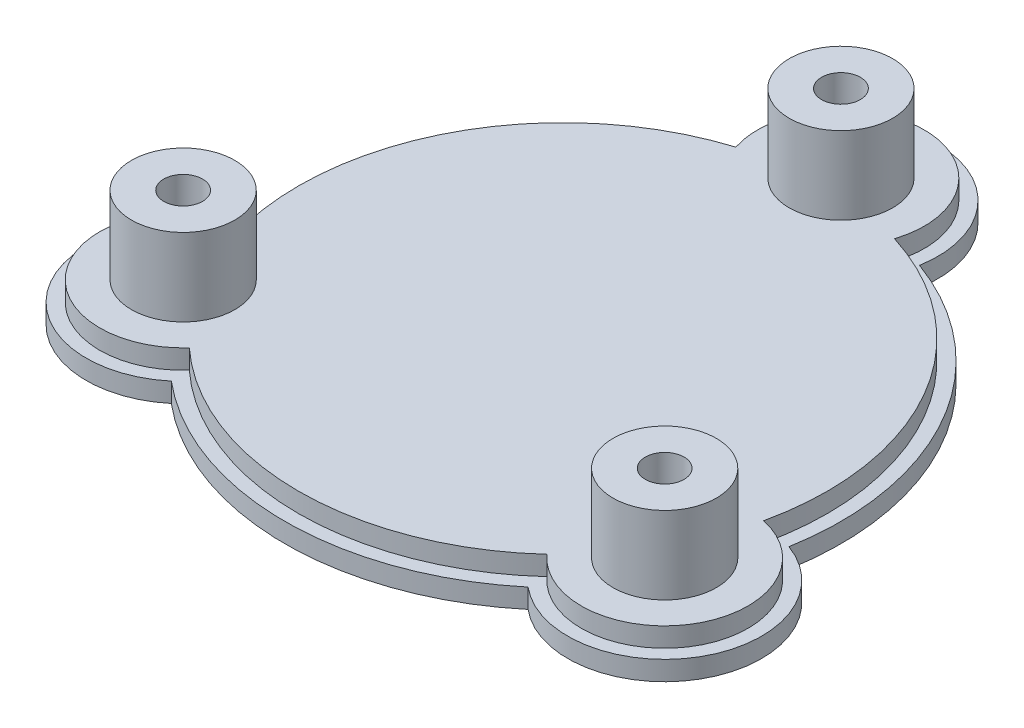
ISO-10303-21;
HEADER;
FILE_DESCRIPTION(('STEP AP214'),'2;1');
FILE_NAME('part.step','',(''),(''),'','','');
FILE_SCHEMA(('AUTOMOTIVE_DESIGN { 1 0 10303 214 1 1 1 1 }'));
ENDSEC;
DATA;
#1=APPLICATION_CONTEXT('core data for automotive mechanical design processes');
#2=APPLICATION_PROTOCOL_DEFINITION('international standard','automotive_design',2000,#1);
#3=PRODUCT_CONTEXT('',#1,'mechanical');
#4=PRODUCT('Part','Part','',(#3));
#5=PRODUCT_RELATED_PRODUCT_CATEGORY('part','',(#4));
#6=PRODUCT_DEFINITION_FORMATION('','',#4);
#7=PRODUCT_DEFINITION_CONTEXT('part definition',#1,'design');
#8=PRODUCT_DEFINITION('design','',#6,#7);
#9=PRODUCT_DEFINITION_SHAPE('','',#8);
#10=(LENGTH_UNIT() NAMED_UNIT(*) SI_UNIT(.MILLI.,.METRE.));
#11=(NAMED_UNIT(*) PLANE_ANGLE_UNIT() SI_UNIT($,.RADIAN.));
#12=(NAMED_UNIT(*) SI_UNIT($,.STERADIAN.) SOLID_ANGLE_UNIT());
#13=UNCERTAINTY_MEASURE_WITH_UNIT(LENGTH_MEASURE(1.E-05),#10,'distance_accuracy_value','');
#14=(GEOMETRIC_REPRESENTATION_CONTEXT(3) GLOBAL_UNCERTAINTY_ASSIGNED_CONTEXT((#13)) GLOBAL_UNIT_ASSIGNED_CONTEXT((#10,
#11,#12)) REPRESENTATION_CONTEXT('',''));
#15=CARTESIAN_POINT('',(0.,0.,0.));
#16=DIRECTION('',(0.,0.,1.));
#17=DIRECTION('',(1.,0.,0.));
#18=AXIS2_PLACEMENT_3D('',#15,#16,#17);
#19=CARTESIAN_POINT('',(37.2390923627336,3.,21.4999999999984));
#20=DIRECTION('',(0.,-1.,0.));
#21=DIRECTION('',(0.,0.,-1.));
#22=AXIS2_PLACEMENT_3D('',#19,#20,#21);
#23=CYLINDRICAL_SURFACE('',#22,6.);
#24=CARTESIAN_POINT('',(37.2390923627336,0.,21.4999999999984));
#25=DIRECTION('',(0.,1.,0.));
#26=DIRECTION('',(0.,0.,1.));
#27=AXIS2_PLACEMENT_3D('',#24,#25,#26);
#28=CIRCLE('',#27,6.);
#29=CARTESIAN_POINT('',(37.2390923627336,0.,27.4999999999984));
#30=VERTEX_POINT('',#29);
#31=EDGE_CURVE('E222',#30,#30,#28,.T.);
#32=ORIENTED_EDGE('',*,*,#31,.F.);
#33=EDGE_LOOP('',(#32));
#34=FACE_BOUND('',#33,.T.);
#35=CARTESIAN_POINT('',(37.2390923627307,12.,21.4999999999972));
#36=DIRECTION('',(0.,1.,0.));
#37=DIRECTION('',(0.,0.,1.));
#38=AXIS2_PLACEMENT_3D('',#35,#36,#37);
#39=CIRCLE('',#38,6.);
#40=CARTESIAN_POINT('',(37.2390923627307,12.,27.4999999999972));
#41=VERTEX_POINT('',#40);
#42=EDGE_CURVE('E410',#41,#41,#39,.T.);
#43=ORIENTED_EDGE('',*,*,#42,.T.);
#44=EDGE_LOOP('',(#43));
#45=FACE_BOUND('',#44,.T.);
#46=ADVANCED_FACE('F219',(#34,#45),#23,.F.);
#47=CARTESIAN_POINT('',(0.,3.,-43.));
#48=DIRECTION('',(0.,-1.,0.));
#49=DIRECTION('',(0.,0.,-1.));
#50=AXIS2_PLACEMENT_3D('',#47,#48,#49);
#51=CYLINDRICAL_SURFACE('',#50,6.);
#52=CARTESIAN_POINT('',(0.,0.,-43.));
#53=DIRECTION('',(0.,1.,0.));
#54=DIRECTION('',(0.,0.,1.));
#55=AXIS2_PLACEMENT_3D('',#52,#53,#54);
#56=CIRCLE('',#55,6.);
#57=CARTESIAN_POINT('',(0.,0.,-37.));
#58=VERTEX_POINT('',#57);
#59=EDGE_CURVE('E345',#58,#58,#56,.T.);
#60=ORIENTED_EDGE('',*,*,#59,.F.);
#61=EDGE_LOOP('',(#60));
#62=FACE_BOUND('',#61,.T.);
#63=CARTESIAN_POINT('',(-2.55698240358981E-12,12.,-42.9999999999984));
#64=DIRECTION('',(0.,1.,0.));
#65=DIRECTION('',(0.,0.,1.));
#66=AXIS2_PLACEMENT_3D('',#63,#64,#65);
#67=CIRCLE('',#66,5.99999999999999);
#68=CARTESIAN_POINT('',(-2.55698240358981E-12,12.,-36.9999999999984));
#69=VERTEX_POINT('',#68);
#70=EDGE_CURVE('E422',#69,#69,#67,.T.);
#71=ORIENTED_EDGE('',*,*,#70,.T.);
#72=EDGE_LOOP('',(#71));
#73=FACE_BOUND('',#72,.T.);
#74=ADVANCED_FACE('F400',(#62,#73),#51,.F.);
#75=CARTESIAN_POINT('',(-37.2390923627281,3.,21.5000000000016));
#76=DIRECTION('',(0.,-1.,0.));
#77=DIRECTION('',(0.,0.,-1.));
#78=AXIS2_PLACEMENT_3D('',#75,#76,#77);
#79=CYLINDRICAL_SURFACE('',#78,6.);
#80=CARTESIAN_POINT('',(-37.2390923627281,0.,21.5000000000016));
#81=DIRECTION('',(0.,1.,0.));
#82=DIRECTION('',(0.,0.,1.));
#83=AXIS2_PLACEMENT_3D('',#80,#81,#82);
#84=CIRCLE('',#83,6.);
#85=CARTESIAN_POINT('',(-37.2390923627281,0.,27.5000000000016));
#86=VERTEX_POINT('',#85);
#87=EDGE_CURVE('E348',#86,#86,#84,.T.);
#88=ORIENTED_EDGE('',*,*,#87,.F.);
#89=EDGE_LOOP('',(#88));
#90=FACE_BOUND('',#89,.T.);
#91=CARTESIAN_POINT('',(-37.2390923627281,12.,21.5000000000016));
#92=DIRECTION('',(0.,1.,0.));
#93=DIRECTION('',(0.,0.,1.));
#94=AXIS2_PLACEMENT_3D('',#91,#92,#93);
#95=CIRCLE('',#94,5.99999999999999);
#96=CARTESIAN_POINT('',(-37.2390923627281,12.,27.5000000000016));
#97=VERTEX_POINT('',#96);
#98=EDGE_CURVE('E440',#97,#97,#95,.T.);
#99=ORIENTED_EDGE('',*,*,#98,.T.);
#100=EDGE_LOOP('',(#99));
#101=FACE_BOUND('',#100,.T.);
#102=ADVANCED_FACE('F405',(#90,#101),#79,.F.);
#103=CARTESIAN_POINT('',(0.,3.,0.));
#104=DIRECTION('',(0.,1.,0.));
#105=DIRECTION('',(0.,0.,1.));
#106=AXIS2_PLACEMENT_3D('',#103,#104,#105);
#107=PLANE('',#106);
#108=CARTESIAN_POINT('',(0.,3.,-43.));
#109=DIRECTION('',(0.,1.,0.));
#110=DIRECTION('',(0.,0.,1.));
#111=AXIS2_PLACEMENT_3D('',#108,#109,#110);
#112=CIRCLE('',#111,12.9);
#113=CARTESIAN_POINT('',(12.2694729939809,3.,-39.0162790697674));
#114=VERTEX_POINT('',#113);
#115=CARTESIAN_POINT('',(-12.2694729939809,3.,-39.0162790697674));
#116=VERTEX_POINT('',#115);
#117=EDGE_CURVE('E489',#114,#116,#112,.T.);
#118=ORIENTED_EDGE('',*,*,#117,.F.);
#119=CARTESIAN_POINT('',(0.,3.,0.));
#120=DIRECTION('',(0.,1.,0.));
#121=DIRECTION('',(0.,0.,1.));
#122=AXIS2_PLACEMENT_3D('',#119,#120,#121);
#123=CIRCLE('',#122,40.9);
#124=CARTESIAN_POINT('',(39.9238253325531,3.,8.88246423104476));
#125=VERTEX_POINT('',#124);
#126=EDGE_CURVE('E447',#125,#114,#123,.T.);
#127=ORIENTED_EDGE('',*,*,#126,.F.);
#128=CARTESIAN_POINT('',(37.2390923627336,3.,21.4999999999984));
#129=DIRECTION('',(0.,1.,0.));
#130=DIRECTION('',(0.,0.,1.));
#131=AXIS2_PLACEMENT_3D('',#128,#129,#130);
#132=CIRCLE('',#131,12.9000000000024);
#133=CARTESIAN_POINT('',(27.6543523385718,3.,30.1338148387178));
#134=VERTEX_POINT('',#133);
#135=EDGE_CURVE('E453',#134,#125,#132,.T.);
#136=ORIENTED_EDGE('',*,*,#135,.F.);
#137=CARTESIAN_POINT('',(0.,3.,0.));
#138=DIRECTION('',(0.,1.,0.));
#139=DIRECTION('',(0.,0.,1.));
#140=AXIS2_PLACEMENT_3D('',#137,#138,#139);
#141=CIRCLE('',#140,40.9);
#142=CARTESIAN_POINT('',(-27.6543523385664,3.,30.1338148387228));
#143=VERTEX_POINT('',#142);
#144=EDGE_CURVE('E501',#143,#134,#141,.T.);
#145=ORIENTED_EDGE('',*,*,#144,.F.);
#146=CARTESIAN_POINT('',(-37.2390923627281,3.,21.5000000000016));
#147=DIRECTION('',(0.,1.,0.));
#148=DIRECTION('',(0.,0.,1.));
#149=AXIS2_PLACEMENT_3D('',#146,#147,#148);
#150=CIRCLE('',#149,12.9000000000035);
#151=CARTESIAN_POINT('',(-39.9238253325525,3.,8.88246423104779));
#152=VERTEX_POINT('',#151);
#153=EDGE_CURVE('E497',#152,#143,#150,.T.);
#154=ORIENTED_EDGE('',*,*,#153,.F.);
#155=CARTESIAN_POINT('',(0.,3.,0.));
#156=DIRECTION('',(0.,1.,0.));
#157=DIRECTION('',(0.,0.,1.));
#158=AXIS2_PLACEMENT_3D('',#155,#156,#157);
#159=CIRCLE('',#158,40.9);
#160=EDGE_CURVE('E493',#116,#152,#159,.T.);
#161=ORIENTED_EDGE('',*,*,#160,.F.);
#162=EDGE_LOOP('',(#118,#127,#136,#145,#154,#161));
#163=FACE_BOUND('',#162,.T.);
#164=CARTESIAN_POINT('',(37.2390923627336,3.,21.4999999999984));
#165=DIRECTION('',(0.,1.,0.));
#166=DIRECTION('',(0.,0.,1.));
#167=AXIS2_PLACEMENT_3D('',#164,#165,#166);
#168=CIRCLE('',#167,15.0000000000024);
#169=CARTESIAN_POINT('',(27.5882912610838,3.,32.9831197022599));
#170=VERTEX_POINT('',#169);
#171=CARTESIAN_POINT('',(42.358365188763,3.,7.40060122796745));
#172=VERTEX_POINT('',#171);
#173=EDGE_CURVE('E369',#170,#172,#168,.T.);
#174=ORIENTED_EDGE('',*,*,#173,.T.);
#175=CARTESIAN_POINT('',(0.,3.,0.));
#176=DIRECTION('',(0.,1.,0.));
#177=DIRECTION('',(0.,0.,1.));
#178=AXIS2_PLACEMENT_3D('',#175,#176,#177);
#179=CIRCLE('',#178,43.);
#180=CARTESIAN_POINT('',(14.7700739276788,3.,-40.3837209302326));
#181=VERTEX_POINT('',#180);
#182=EDGE_CURVE('E280',#172,#181,#179,.T.);
#183=ORIENTED_EDGE('',*,*,#182,.T.);
#184=CARTESIAN_POINT('',(0.,3.,-43.));
#185=DIRECTION('',(0.,1.,0.));
#186=DIRECTION('',(0.,0.,1.));
#187=AXIS2_PLACEMENT_3D('',#184,#185,#186);
#188=CIRCLE('',#187,15.);
#189=CARTESIAN_POINT('',(-14.7700739276788,3.,-40.3837209302326));
#190=VERTEX_POINT('',#189);
#191=EDGE_CURVE('E298',#181,#190,#188,.T.);
#192=ORIENTED_EDGE('',*,*,#191,.T.);
#193=CARTESIAN_POINT('',(-42.3583651887623,3.,7.40060122797118));
#194=VERTEX_POINT('',#193);
#195=EDGE_CURVE('E291',#190,#194,#179,.T.);
#196=ORIENTED_EDGE('',*,*,#195,.T.);
#197=CARTESIAN_POINT('',(-37.2390923627281,3.,21.5000000000016));
#198=DIRECTION('',(0.,1.,0.));
#199=DIRECTION('',(0.,0.,1.));
#200=AXIS2_PLACEMENT_3D('',#197,#198,#199);
#201=CIRCLE('',#200,15.0000000000035);
#202=CARTESIAN_POINT('',(-27.5882912610783,3.,32.9831197022645));
#203=VERTEX_POINT('',#202);
#204=EDGE_CURVE('E295',#194,#203,#201,.T.);
#205=ORIENTED_EDGE('',*,*,#204,.T.);
#206=EDGE_CURVE('E245',#203,#170,#179,.T.);
#207=ORIENTED_EDGE('',*,*,#206,.T.);
#208=EDGE_LOOP('',(#174,#183,#192,#196,#205,#207));
#209=FACE_BOUND('',#208,.T.);
#210=ADVANCED_FACE('F293',(#163,#209),#107,.T.);
#211=CARTESIAN_POINT('',(0.,3.,0.));
#212=DIRECTION('',(0.,-1.,0.));
#213=DIRECTION('',(0.,0.,-1.));
#214=AXIS2_PLACEMENT_3D('',#211,#212,#213);
#215=CYLINDRICAL_SURFACE('',#214,43.);
#216=CARTESIAN_POINT('',(0.,0.,0.));
#217=DIRECTION('',(0.,1.,0.));
#218=DIRECTION('',(0.,0.,1.));
#219=AXIS2_PLACEMENT_3D('',#216,#217,#218);
#220=CIRCLE('',#219,43.);
#221=CARTESIAN_POINT('',(42.358365188763,0.,7.40060122796745));
#222=VERTEX_POINT('',#221);
#223=CARTESIAN_POINT('',(14.7700739276788,0.,-40.3837209302326));
#224=VERTEX_POINT('',#223);
#225=EDGE_CURVE('E324',#222,#224,#220,.T.);
#226=ORIENTED_EDGE('',*,*,#225,.T.);
#227=DIRECTION('',(0.,-1.,0.));
#228=VECTOR('',#227,1.);
#229=CARTESIAN_POINT('',(14.7700739276788,3.,-40.3837209302326));
#230=LINE('',#229,#228);
#231=EDGE_CURVE('E228',#181,#224,#230,.T.);
#232=ORIENTED_EDGE('',*,*,#231,.F.);
#233=ORIENTED_EDGE('',*,*,#182,.F.);
#234=DIRECTION('',(0.,-1.,0.));
#235=VECTOR('',#234,1.);
#236=CARTESIAN_POINT('',(42.358365188763,3.,7.40060122796745));
#237=LINE('',#236,#235);
#238=EDGE_CURVE('E12',#172,#222,#237,.T.);
#239=ORIENTED_EDGE('',*,*,#238,.T.);
#240=EDGE_LOOP('',(#226,#232,#233,#239));
#241=FACE_BOUND('',#240,.T.);
#242=ADVANCED_FACE('F379',(#241),#215,.T.);
#243=CARTESIAN_POINT('',(-14.7700739276788,0.,-40.3837209302326));
#244=VERTEX_POINT('',#243);
#245=CARTESIAN_POINT('',(-42.3583651887623,0.,7.40060122797118));
#246=VERTEX_POINT('',#245);
#247=EDGE_CURVE('E306',#244,#246,#220,.T.);
#248=ORIENTED_EDGE('',*,*,#247,.T.);
#249=DIRECTION('',(0.,-1.,0.));
#250=VECTOR('',#249,1.);
#251=CARTESIAN_POINT('',(-42.3583651887623,3.,7.40060122797118));
#252=LINE('',#251,#250);
#253=EDGE_CURVE('E303',#194,#246,#252,.T.);
#254=ORIENTED_EDGE('',*,*,#253,.F.);
#255=ORIENTED_EDGE('',*,*,#195,.F.);
#256=DIRECTION('',(0.,-1.,0.));
#257=VECTOR('',#256,1.);
#258=CARTESIAN_POINT('',(-14.7700739276788,3.,-40.3837209302326));
#259=LINE('',#258,#257);
#260=EDGE_CURVE('E310',#190,#244,#259,.T.);
#261=ORIENTED_EDGE('',*,*,#260,.T.);
#262=EDGE_LOOP('',(#248,#254,#255,#261));
#263=FACE_BOUND('',#262,.T.);
#264=ADVANCED_FACE('F304',(#263),#215,.T.);
#265=CARTESIAN_POINT('',(-37.2390923627281,3.,21.5000000000016));
#266=DIRECTION('',(0.,-1.,0.));
#267=DIRECTION('',(0.,0.,-1.));
#268=AXIS2_PLACEMENT_3D('',#265,#266,#267);
#269=CYLINDRICAL_SURFACE('',#268,15.0000000000035);
#270=CARTESIAN_POINT('',(-37.2390923627281,0.,21.5000000000016));
#271=DIRECTION('',(0.,1.,0.));
#272=DIRECTION('',(0.,0.,1.));
#273=AXIS2_PLACEMENT_3D('',#270,#271,#272);
#274=CIRCLE('',#273,15.0000000000035);
#275=CARTESIAN_POINT('',(-27.5882912610783,0.,32.9831197022645));
#276=VERTEX_POINT('',#275);
#277=EDGE_CURVE('E328',#246,#276,#274,.T.);
#278=ORIENTED_EDGE('',*,*,#277,.T.);
#279=DIRECTION('',(0.,-1.,0.));
#280=VECTOR('',#279,1.);
#281=CARTESIAN_POINT('',(-27.5882912610783,3.,32.9831197022645));
#282=LINE('',#281,#280);
#283=EDGE_CURVE('E311',#203,#276,#282,.T.);
#284=ORIENTED_EDGE('',*,*,#283,.F.);
#285=ORIENTED_EDGE('',*,*,#204,.F.);
#286=ORIENTED_EDGE('',*,*,#253,.T.);
#287=EDGE_LOOP('',(#278,#284,#285,#286));
#288=FACE_BOUND('',#287,.T.);
#289=ADVANCED_FACE('F313',(#288),#269,.T.);
#290=CARTESIAN_POINT('',(27.5882912610838,0.,32.9831197022599));
#291=VERTEX_POINT('',#290);
#292=EDGE_CURVE('E272',#276,#291,#220,.T.);
#293=ORIENTED_EDGE('',*,*,#292,.T.);
#294=DIRECTION('',(0.,-1.,0.));
#295=VECTOR('',#294,1.);
#296=CARTESIAN_POINT('',(27.5882912610838,3.,32.9831197022599));
#297=LINE('',#296,#295);
#298=EDGE_CURVE('E317',#170,#291,#297,.T.);
#299=ORIENTED_EDGE('',*,*,#298,.F.);
#300=ORIENTED_EDGE('',*,*,#206,.F.);
#301=ORIENTED_EDGE('',*,*,#283,.T.);
#302=EDGE_LOOP('',(#293,#299,#300,#301));
#303=FACE_BOUND('',#302,.T.);
#304=ADVANCED_FACE('F558',(#303),#215,.T.);
#305=CARTESIAN_POINT('',(37.2390923627336,3.,21.4999999999984));
#306=DIRECTION('',(0.,-1.,0.));
#307=DIRECTION('',(0.,0.,-1.));
#308=AXIS2_PLACEMENT_3D('',#305,#306,#307);
#309=CYLINDRICAL_SURFACE('',#308,15.0000000000024);
#310=CARTESIAN_POINT('',(37.2390923627336,0.,21.4999999999984));
#311=DIRECTION('',(0.,1.,0.));
#312=DIRECTION('',(0.,0.,1.));
#313=AXIS2_PLACEMENT_3D('',#310,#311,#312);
#314=CIRCLE('',#313,15.0000000000024);
#315=EDGE_CURVE('E320',#291,#222,#314,.T.);
#316=ORIENTED_EDGE('',*,*,#315,.T.);
#317=ORIENTED_EDGE('',*,*,#238,.F.);
#318=ORIENTED_EDGE('',*,*,#173,.F.);
#319=ORIENTED_EDGE('',*,*,#298,.T.);
#320=EDGE_LOOP('',(#316,#317,#318,#319));
#321=FACE_BOUND('',#320,.T.);
#322=ADVANCED_FACE('F377',(#321),#309,.T.);
#323=CARTESIAN_POINT('',(0.,0.,0.));
#324=DIRECTION('',(0.,1.,0.));
#325=DIRECTION('',(0.,0.,1.));
#326=AXIS2_PLACEMENT_3D('',#323,#324,#325);
#327=PLANE('',#326);
#328=ORIENTED_EDGE('',*,*,#59,.T.);
#329=EDGE_LOOP('',(#328));
#330=FACE_BOUND('',#329,.T.);
#331=ORIENTED_EDGE('',*,*,#315,.F.);
#332=ORIENTED_EDGE('',*,*,#292,.F.);
#333=ORIENTED_EDGE('',*,*,#277,.F.);
#334=ORIENTED_EDGE('',*,*,#247,.F.);
#335=CARTESIAN_POINT('',(0.,0.,-43.));
#336=DIRECTION('',(0.,1.,0.));
#337=DIRECTION('',(0.,0.,1.));
#338=AXIS2_PLACEMENT_3D('',#335,#336,#337);
#339=CIRCLE('',#338,15.);
#340=EDGE_CURVE('E341',#224,#244,#339,.T.);
#341=ORIENTED_EDGE('',*,*,#340,.F.);
#342=ORIENTED_EDGE('',*,*,#225,.F.);
#343=EDGE_LOOP('',(#331,#332,#333,#334,#341,#342));
#344=FACE_BOUND('',#343,.T.);
#345=ORIENTED_EDGE('',*,*,#87,.T.);
#346=EDGE_LOOP('',(#345));
#347=FACE_BOUND('',#346,.T.);
#348=ORIENTED_EDGE('',*,*,#31,.T.);
#349=EDGE_LOOP('',(#348));
#350=FACE_BOUND('',#349,.T.);
#351=ADVANCED_FACE('F382',(#330,#344,#347,#350),#327,.F.);
#352=CARTESIAN_POINT('',(0.,3.,-43.));
#353=DIRECTION('',(0.,-1.,0.));
#354=DIRECTION('',(0.,0.,-1.));
#355=AXIS2_PLACEMENT_3D('',#352,#353,#354);
#356=CYLINDRICAL_SURFACE('',#355,15.);
#357=ORIENTED_EDGE('',*,*,#340,.T.);
#358=ORIENTED_EDGE('',*,*,#260,.F.);
#359=ORIENTED_EDGE('',*,*,#191,.F.);
#360=ORIENTED_EDGE('',*,*,#231,.T.);
#361=EDGE_LOOP('',(#357,#358,#359,#360));
#362=FACE_BOUND('',#361,.T.);
#363=ADVANCED_FACE('F384',(#362),#356,.T.);
#364=CARTESIAN_POINT('',(-37.2390923627281,18.,21.5000000000016));
#365=DIRECTION('',(0.,-1.,0.));
#366=DIRECTION('',(0.,0.,-1.));
#367=AXIS2_PLACEMENT_3D('',#364,#365,#366);
#368=CYLINDRICAL_SURFACE('',#367,8.00000000000345);
#369=CARTESIAN_POINT('',(-37.2390923627281,6.,21.5000000000016));
#370=DIRECTION('',(0.,1.,0.));
#371=DIRECTION('',(0.,0.,1.));
#372=AXIS2_PLACEMENT_3D('',#369,#370,#371);
#373=CIRCLE('',#372,8.00000000000345);
#374=CARTESIAN_POINT('',(-37.2390923627281,6.,29.500000000005));
#375=VERTEX_POINT('',#374);
#376=EDGE_CURVE('E457',#375,#375,#373,.F.);
#377=ORIENTED_EDGE('',*,*,#376,.F.);
#378=EDGE_LOOP('',(#377));
#379=FACE_BOUND('',#378,.T.);
#380=CARTESIAN_POINT('',(-37.2390923627281,18.,21.5000000000016));
#381=DIRECTION('',(0.,1.,0.));
#382=DIRECTION('',(0.,0.,1.));
#383=AXIS2_PLACEMENT_3D('',#380,#381,#382);
#384=CIRCLE('',#383,8.00000000000345);
#385=CARTESIAN_POINT('',(-37.2390923627281,18.,29.500000000005));
#386=VERTEX_POINT('',#385);
#387=EDGE_CURVE('E355',#386,#386,#384,.T.);
#388=ORIENTED_EDGE('',*,*,#387,.F.);
#389=EDGE_LOOP('',(#388));
#390=FACE_BOUND('',#389,.T.);
#391=ADVANCED_FACE('F386',(#379,#390),#368,.T.);
#392=CARTESIAN_POINT('',(0.,18.,0.));
#393=DIRECTION('',(0.,1.,0.));
#394=DIRECTION('',(0.,0.,1.));
#395=AXIS2_PLACEMENT_3D('',#392,#393,#394);
#396=PLANE('',#395);
#397=ORIENTED_EDGE('',*,*,#387,.T.);
#398=EDGE_LOOP('',(#397));
#399=FACE_BOUND('',#398,.T.);
#400=CARTESIAN_POINT('',(-37.2390923627281,18.,21.5000000000016));
#401=DIRECTION('',(0.,1.,0.));
#402=DIRECTION('',(0.,0.,1.));
#403=AXIS2_PLACEMENT_3D('',#400,#401,#402);
#404=CIRCLE('',#403,3.);
#405=CARTESIAN_POINT('',(-37.2390923627281,18.,24.5000000000016));
#406=VERTEX_POINT('',#405);
#407=EDGE_CURVE('E432',#406,#406,#404,.T.);
#408=ORIENTED_EDGE('',*,*,#407,.F.);
#409=EDGE_LOOP('',(#408));
#410=FACE_BOUND('',#409,.T.);
#411=ADVANCED_FACE('F392',(#399,#410),#396,.T.);
#412=CARTESIAN_POINT('',(37.2390923627336,18.,21.4999999999984));
#413=DIRECTION('',(0.,-1.,0.));
#414=DIRECTION('',(0.,0.,-1.));
#415=AXIS2_PLACEMENT_3D('',#412,#413,#414);
#416=CYLINDRICAL_SURFACE('',#415,8.00000000000236);
#417=CARTESIAN_POINT('',(37.2390923627336,6.,21.4999999999984));
#418=DIRECTION('',(0.,1.,0.));
#419=DIRECTION('',(0.,0.,1.));
#420=AXIS2_PLACEMENT_3D('',#417,#418,#419);
#421=CIRCLE('',#420,8.00000000000236);
#422=CARTESIAN_POINT('',(37.2390923627336,6.,29.5000000000008));
#423=VERTEX_POINT('',#422);
#424=EDGE_CURVE('E448',#423,#423,#421,.F.);
#425=ORIENTED_EDGE('',*,*,#424,.F.);
#426=EDGE_LOOP('',(#425));
#427=FACE_BOUND('',#426,.T.);
#428=CARTESIAN_POINT('',(37.2390923627336,18.,21.4999999999984));
#429=DIRECTION('',(0.,1.,0.));
#430=DIRECTION('',(0.,0.,1.));
#431=AXIS2_PLACEMENT_3D('',#428,#429,#430);
#432=CIRCLE('',#431,8.00000000000236);
#433=CARTESIAN_POINT('',(37.2390923627336,18.,29.5000000000008));
#434=VERTEX_POINT('',#433);
#435=EDGE_CURVE('E360',#434,#434,#432,.T.);
#436=ORIENTED_EDGE('',*,*,#435,.F.);
#437=EDGE_LOOP('',(#436));
#438=FACE_BOUND('',#437,.T.);
#439=ADVANCED_FACE('F544',(#427,#438),#416,.T.);
#440=CARTESIAN_POINT('',(0.,18.,0.));
#441=DIRECTION('',(0.,1.,0.));
#442=DIRECTION('',(0.,0.,1.));
#443=AXIS2_PLACEMENT_3D('',#440,#441,#442);
#444=PLANE('',#443);
#445=ORIENTED_EDGE('',*,*,#435,.T.);
#446=EDGE_LOOP('',(#445));
#447=FACE_BOUND('',#446,.T.);
#448=CARTESIAN_POINT('',(37.2390923627307,18.,21.4999999999972));
#449=DIRECTION('',(0.,1.,0.));
#450=DIRECTION('',(0.,0.,1.));
#451=AXIS2_PLACEMENT_3D('',#448,#449,#450);
#452=CIRCLE('',#451,3.);
#453=CARTESIAN_POINT('',(37.2390923627307,18.,24.4999999999972));
#454=VERTEX_POINT('',#453);
#455=EDGE_CURVE('E417',#454,#454,#452,.T.);
#456=ORIENTED_EDGE('',*,*,#455,.F.);
#457=EDGE_LOOP('',(#456));
#458=FACE_BOUND('',#457,.T.);
#459=ADVANCED_FACE('F535',(#447,#458),#444,.T.);
#460=CARTESIAN_POINT('',(0.,18.,-43.));
#461=DIRECTION('',(0.,-1.,0.));
#462=DIRECTION('',(0.,0.,-1.));
#463=AXIS2_PLACEMENT_3D('',#460,#461,#462);
#464=CYLINDRICAL_SURFACE('',#463,8.);
#465=CARTESIAN_POINT('',(0.,6.,-43.));
#466=DIRECTION('',(0.,1.,0.));
#467=DIRECTION('',(0.,0.,1.));
#468=AXIS2_PLACEMENT_3D('',#465,#466,#467);
#469=CIRCLE('',#468,8.);
#470=CARTESIAN_POINT('',(0.,6.,-35.));
#471=VERTEX_POINT('',#470);
#472=EDGE_CURVE('E452',#471,#471,#469,.F.);
#473=ORIENTED_EDGE('',*,*,#472,.F.);
#474=EDGE_LOOP('',(#473));
#475=FACE_BOUND('',#474,.T.);
#476=CARTESIAN_POINT('',(0.,18.,-43.));
#477=DIRECTION('',(0.,1.,0.));
#478=DIRECTION('',(0.,0.,1.));
#479=AXIS2_PLACEMENT_3D('',#476,#477,#478);
#480=CIRCLE('',#479,8.);
#481=CARTESIAN_POINT('',(0.,18.,-35.));
#482=VERTEX_POINT('',#481);
#483=EDGE_CURVE('E366',#482,#482,#480,.T.);
#484=ORIENTED_EDGE('',*,*,#483,.F.);
#485=EDGE_LOOP('',(#484));
#486=FACE_BOUND('',#485,.T.);
#487=ADVANCED_FACE('F533',(#475,#486),#464,.T.);
#488=CARTESIAN_POINT('',(0.,18.,0.));
#489=DIRECTION('',(0.,1.,0.));
#490=DIRECTION('',(0.,0.,1.));
#491=AXIS2_PLACEMENT_3D('',#488,#489,#490);
#492=PLANE('',#491);
#493=ORIENTED_EDGE('',*,*,#483,.T.);
#494=EDGE_LOOP('',(#493));
#495=FACE_BOUND('',#494,.T.);
#496=CARTESIAN_POINT('',(-2.55698240358981E-12,18.,-42.9999999999984));
#497=DIRECTION('',(0.,1.,0.));
#498=DIRECTION('',(0.,0.,1.));
#499=AXIS2_PLACEMENT_3D('',#496,#497,#498);
#500=CIRCLE('',#499,3.);
#501=CARTESIAN_POINT('',(-2.55698240358981E-12,18.,-39.9999999999984));
#502=VERTEX_POINT('',#501);
#503=EDGE_CURVE('E428',#502,#502,#500,.T.);
#504=ORIENTED_EDGE('',*,*,#503,.F.);
#505=EDGE_LOOP('',(#504));
#506=FACE_BOUND('',#505,.T.);
#507=ADVANCED_FACE('F530',(#495,#506),#492,.T.);
#508=CARTESIAN_POINT('',(0.,6.,0.));
#509=DIRECTION('',(0.,-1.,0.));
#510=DIRECTION('',(0.,0.,-1.));
#511=AXIS2_PLACEMENT_3D('',#508,#509,#510);
#512=CYLINDRICAL_SURFACE('',#511,40.9);
#513=ORIENTED_EDGE('',*,*,#126,.T.);
#514=DIRECTION('',(0.,-1.,0.));
#515=VECTOR('',#514,1.);
#516=CARTESIAN_POINT('',(12.2694729939809,6.,-39.0162790697674));
#517=LINE('',#516,#515);
#518=CARTESIAN_POINT('',(12.2694729939809,6.,-39.0162790697674));
#519=VERTEX_POINT('',#518);
#520=EDGE_CURVE('E523',#519,#114,#517,.T.);
#521=ORIENTED_EDGE('',*,*,#520,.F.);
#522=CARTESIAN_POINT('',(0.,6.,0.));
#523=DIRECTION('',(0.,1.,0.));
#524=DIRECTION('',(0.,0.,1.));
#525=AXIS2_PLACEMENT_3D('',#522,#523,#524);
#526=CIRCLE('',#525,40.9);
#527=CARTESIAN_POINT('',(39.9238253325531,6.,8.88246423104476));
#528=VERTEX_POINT('',#527);
#529=EDGE_CURVE('E461',#528,#519,#526,.T.);
#530=ORIENTED_EDGE('',*,*,#529,.F.);
#531=DIRECTION('',(0.,-1.,0.));
#532=VECTOR('',#531,1.);
#533=CARTESIAN_POINT('',(39.9238253325531,6.,8.88246423104476));
#534=LINE('',#533,#532);
#535=EDGE_CURVE('E485',#528,#125,#534,.T.);
#536=ORIENTED_EDGE('',*,*,#535,.T.);
#537=EDGE_LOOP('',(#513,#521,#530,#536));
#538=FACE_BOUND('',#537,.T.);
#539=ADVANCED_FACE('F542',(#538),#512,.T.);
#540=CARTESIAN_POINT('',(0.,6.,-43.));
#541=DIRECTION('',(0.,-1.,0.));
#542=DIRECTION('',(0.,0.,-1.));
#543=AXIS2_PLACEMENT_3D('',#540,#541,#542);
#544=CYLINDRICAL_SURFACE('',#543,12.9);
#545=ORIENTED_EDGE('',*,*,#117,.T.);
#546=DIRECTION('',(0.,-1.,0.));
#547=VECTOR('',#546,1.);
#548=CARTESIAN_POINT('',(-12.2694729939809,6.,-39.0162790697674));
#549=LINE('',#548,#547);
#550=CARTESIAN_POINT('',(-12.2694729939809,6.,-39.0162790697674));
#551=VERTEX_POINT('',#550);
#552=EDGE_CURVE('E519',#551,#116,#549,.T.);
#553=ORIENTED_EDGE('',*,*,#552,.F.);
#554=CARTESIAN_POINT('',(0.,6.,-43.));
#555=DIRECTION('',(0.,1.,0.));
#556=DIRECTION('',(0.,0.,1.));
#557=AXIS2_PLACEMENT_3D('',#554,#555,#556);
#558=CIRCLE('',#557,12.9);
#559=EDGE_CURVE('E465',#519,#551,#558,.T.);
#560=ORIENTED_EDGE('',*,*,#559,.F.);
#561=ORIENTED_EDGE('',*,*,#520,.T.);
#562=EDGE_LOOP('',(#545,#553,#560,#561));
#563=FACE_BOUND('',#562,.T.);
#564=ADVANCED_FACE('F617',(#563),#544,.T.);
#565=CARTESIAN_POINT('',(0.,6.,0.));
#566=DIRECTION('',(0.,-1.,0.));
#567=DIRECTION('',(0.,0.,-1.));
#568=AXIS2_PLACEMENT_3D('',#565,#566,#567);
#569=CYLINDRICAL_SURFACE('',#568,40.9);
#570=ORIENTED_EDGE('',*,*,#160,.T.);
#571=DIRECTION('',(0.,-1.,0.));
#572=VECTOR('',#571,1.);
#573=CARTESIAN_POINT('',(-39.9238253325525,6.,8.88246423104779));
#574=LINE('',#573,#572);
#575=CARTESIAN_POINT('',(-39.9238253325525,6.,8.88246423104779));
#576=VERTEX_POINT('',#575);
#577=EDGE_CURVE('E515',#576,#152,#574,.T.);
#578=ORIENTED_EDGE('',*,*,#577,.F.);
#579=CARTESIAN_POINT('',(0.,6.,0.));
#580=DIRECTION('',(0.,1.,0.));
#581=DIRECTION('',(0.,0.,1.));
#582=AXIS2_PLACEMENT_3D('',#579,#580,#581);
#583=CIRCLE('',#582,40.9);
#584=EDGE_CURVE('E469',#551,#576,#583,.T.);
#585=ORIENTED_EDGE('',*,*,#584,.F.);
#586=ORIENTED_EDGE('',*,*,#552,.T.);
#587=EDGE_LOOP('',(#570,#578,#585,#586));
#588=FACE_BOUND('',#587,.T.);
#589=ADVANCED_FACE('F628',(#588),#569,.T.);
#590=CARTESIAN_POINT('',(-37.2390923627281,6.,21.5000000000016));
#591=DIRECTION('',(0.,-1.,0.));
#592=DIRECTION('',(0.,0.,-1.));
#593=AXIS2_PLACEMENT_3D('',#590,#591,#592);
#594=CYLINDRICAL_SURFACE('',#593,12.9000000000035);
#595=ORIENTED_EDGE('',*,*,#153,.T.);
#596=DIRECTION('',(0.,-1.,0.));
#597=VECTOR('',#596,1.);
#598=CARTESIAN_POINT('',(-27.6543523385664,6.,30.1338148387228));
#599=LINE('',#598,#597);
#600=CARTESIAN_POINT('',(-27.6543523385664,6.,30.1338148387228));
#601=VERTEX_POINT('',#600);
#602=EDGE_CURVE('E511',#601,#143,#599,.T.);
#603=ORIENTED_EDGE('',*,*,#602,.F.);
#604=CARTESIAN_POINT('',(-37.2390923627281,6.,21.5000000000016));
#605=DIRECTION('',(0.,1.,0.));
#606=DIRECTION('',(0.,0.,1.));
#607=AXIS2_PLACEMENT_3D('',#604,#605,#606);
#608=CIRCLE('',#607,12.9000000000035);
#609=EDGE_CURVE('E473',#576,#601,#608,.T.);
#610=ORIENTED_EDGE('',*,*,#609,.F.);
#611=ORIENTED_EDGE('',*,*,#577,.T.);
#612=EDGE_LOOP('',(#595,#603,#610,#611));
#613=FACE_BOUND('',#612,.T.);
#614=ADVANCED_FACE('F639',(#613),#594,.T.);
#615=CARTESIAN_POINT('',(0.,6.,0.));
#616=DIRECTION('',(0.,-1.,0.));
#617=DIRECTION('',(0.,0.,-1.));
#618=AXIS2_PLACEMENT_3D('',#615,#616,#617);
#619=CYLINDRICAL_SURFACE('',#618,40.9);
#620=ORIENTED_EDGE('',*,*,#144,.T.);
#621=DIRECTION('',(0.,-1.,0.));
#622=VECTOR('',#621,1.);
#623=CARTESIAN_POINT('',(27.6543523385718,6.,30.1338148387178));
#624=LINE('',#623,#622);
#625=CARTESIAN_POINT('',(27.6543523385718,6.,30.1338148387178));
#626=VERTEX_POINT('',#625);
#627=EDGE_CURVE('E236',#626,#134,#624,.T.);
#628=ORIENTED_EDGE('',*,*,#627,.F.);
#629=CARTESIAN_POINT('',(0.,6.,0.));
#630=DIRECTION('',(0.,1.,0.));
#631=DIRECTION('',(0.,0.,1.));
#632=AXIS2_PLACEMENT_3D('',#629,#630,#631);
#633=CIRCLE('',#632,40.9);
#634=EDGE_CURVE('E477',#601,#626,#633,.T.);
#635=ORIENTED_EDGE('',*,*,#634,.F.);
#636=ORIENTED_EDGE('',*,*,#602,.T.);
#637=EDGE_LOOP('',(#620,#628,#635,#636));
#638=FACE_BOUND('',#637,.T.);
#639=ADVANCED_FACE('F650',(#638),#619,.T.);
#640=CARTESIAN_POINT('',(37.2390923627336,6.,21.4999999999984));
#641=DIRECTION('',(0.,-1.,0.));
#642=DIRECTION('',(0.,0.,-1.));
#643=AXIS2_PLACEMENT_3D('',#640,#641,#642);
#644=CYLINDRICAL_SURFACE('',#643,12.9000000000024);
#645=ORIENTED_EDGE('',*,*,#135,.T.);
#646=ORIENTED_EDGE('',*,*,#535,.F.);
#647=CARTESIAN_POINT('',(37.2390923627336,6.,21.4999999999984));
#648=DIRECTION('',(0.,1.,0.));
#649=DIRECTION('',(0.,0.,1.));
#650=AXIS2_PLACEMENT_3D('',#647,#648,#649);
#651=CIRCLE('',#650,12.9000000000024);
#652=EDGE_CURVE('E481',#626,#528,#651,.T.);
#653=ORIENTED_EDGE('',*,*,#652,.F.);
#654=ORIENTED_EDGE('',*,*,#627,.T.);
#655=EDGE_LOOP('',(#645,#646,#653,#654));
#656=FACE_BOUND('',#655,.T.);
#657=ADVANCED_FACE('F661',(#656),#644,.T.);
#658=CARTESIAN_POINT('',(0.,6.,0.));
#659=DIRECTION('',(0.,1.,0.));
#660=DIRECTION('',(0.,0.,1.));
#661=AXIS2_PLACEMENT_3D('',#658,#659,#660);
#662=PLANE('',#661);
#663=ORIENTED_EDGE('',*,*,#424,.T.);
#664=EDGE_LOOP('',(#663));
#665=FACE_BOUND('',#664,.T.);
#666=ORIENTED_EDGE('',*,*,#472,.T.);
#667=EDGE_LOOP('',(#666));
#668=FACE_BOUND('',#667,.T.);
#669=ORIENTED_EDGE('',*,*,#376,.T.);
#670=EDGE_LOOP('',(#669));
#671=FACE_BOUND('',#670,.T.);
#672=ORIENTED_EDGE('',*,*,#529,.T.);
#673=ORIENTED_EDGE('',*,*,#559,.T.);
#674=ORIENTED_EDGE('',*,*,#584,.T.);
#675=ORIENTED_EDGE('',*,*,#609,.T.);
#676=ORIENTED_EDGE('',*,*,#634,.T.);
#677=ORIENTED_EDGE('',*,*,#652,.T.);
#678=EDGE_LOOP('',(#672,#673,#674,#675,#676,#677));
#679=FACE_BOUND('',#678,.T.);
#680=ADVANCED_FACE('F672',(#665,#668,#671,#679),#662,.T.);
#681=CARTESIAN_POINT('',(-37.2390923627281,12.,21.5000000000016));
#682=DIRECTION('',(0.,1.,0.));
#683=DIRECTION('',(0.,0.,1.));
#684=AXIS2_PLACEMENT_3D('',#681,#682,#683);
#685=PLANE('',#684);
#686=CARTESIAN_POINT('',(-37.2390923627281,12.,21.5000000000016));
#687=DIRECTION('',(0.,1.,0.));
#688=DIRECTION('',(0.,0.,1.));
#689=AXIS2_PLACEMENT_3D('',#686,#687,#688);
#690=CIRCLE('',#689,3.);
#691=CARTESIAN_POINT('',(-37.2390923627281,12.,24.5000000000016));
#692=VERTEX_POINT('',#691);
#693=EDGE_CURVE('E436',#692,#692,#690,.T.);
#694=ORIENTED_EDGE('',*,*,#693,.T.);
#695=EDGE_LOOP('',(#694));
#696=FACE_BOUND('',#695,.T.);
#697=ORIENTED_EDGE('',*,*,#98,.F.);
#698=EDGE_LOOP('',(#697));
#699=FACE_BOUND('',#698,.T.);
#700=ADVANCED_FACE('F681',(#696,#699),#685,.F.);
#701=CARTESIAN_POINT('',(-37.2390923627281,12.,21.5000000000016));
#702=DIRECTION('',(0.,1.,0.));
#703=DIRECTION('',(0.,0.,1.));
#704=AXIS2_PLACEMENT_3D('',#701,#702,#703);
#705=CYLINDRICAL_SURFACE('',#704,3.);
#706=ORIENTED_EDGE('',*,*,#693,.F.);
#707=EDGE_LOOP('',(#706));
#708=FACE_BOUND('',#707,.T.);
#709=ORIENTED_EDGE('',*,*,#407,.T.);
#710=EDGE_LOOP('',(#709));
#711=FACE_BOUND('',#710,.T.);
#712=ADVANCED_FACE('F730',(#708,#711),#705,.F.);
#713=CARTESIAN_POINT('',(-2.55698240358981E-12,12.,-42.9999999999984));
#714=DIRECTION('',(0.,1.,0.));
#715=DIRECTION('',(0.,0.,1.));
#716=AXIS2_PLACEMENT_3D('',#713,#714,#715);
#717=PLANE('',#716);
#718=CARTESIAN_POINT('',(-2.55698240358981E-12,12.,-42.9999999999984));
#719=DIRECTION('',(0.,1.,0.));
#720=DIRECTION('',(0.,0.,1.));
#721=AXIS2_PLACEMENT_3D('',#718,#719,#720);
#722=CIRCLE('',#721,3.);
#723=CARTESIAN_POINT('',(-2.55698240358981E-12,12.,-39.9999999999984));
#724=VERTEX_POINT('',#723);
#725=EDGE_CURVE('E427',#724,#724,#722,.T.);
#726=ORIENTED_EDGE('',*,*,#725,.T.);
#727=EDGE_LOOP('',(#726));
#728=FACE_BOUND('',#727,.T.);
#729=ORIENTED_EDGE('',*,*,#70,.F.);
#730=EDGE_LOOP('',(#729));
#731=FACE_BOUND('',#730,.T.);
#732=ADVANCED_FACE('F740',(#728,#731),#717,.F.);
#733=CARTESIAN_POINT('',(-2.55698240358981E-12,12.,-42.9999999999984));
#734=DIRECTION('',(0.,1.,0.));
#735=DIRECTION('',(0.,0.,1.));
#736=AXIS2_PLACEMENT_3D('',#733,#734,#735);
#737=CYLINDRICAL_SURFACE('',#736,3.);
#738=ORIENTED_EDGE('',*,*,#725,.F.);
#739=EDGE_LOOP('',(#738));
#740=FACE_BOUND('',#739,.T.);
#741=ORIENTED_EDGE('',*,*,#503,.T.);
#742=EDGE_LOOP('',(#741));
#743=FACE_BOUND('',#742,.T.);
#744=ADVANCED_FACE('F751',(#740,#743),#737,.F.);
#745=CARTESIAN_POINT('',(37.2390923627307,12.,21.4999999999972));
#746=DIRECTION('',(0.,1.,0.));
#747=DIRECTION('',(0.,0.,1.));
#748=AXIS2_PLACEMENT_3D('',#745,#746,#747);
#749=PLANE('',#748);
#750=CARTESIAN_POINT('',(37.2390923627307,12.,21.4999999999972));
#751=DIRECTION('',(0.,1.,0.));
#752=DIRECTION('',(0.,0.,1.));
#753=AXIS2_PLACEMENT_3D('',#750,#751,#752);
#754=CIRCLE('',#753,3.);
#755=CARTESIAN_POINT('',(37.2390923627307,12.,24.4999999999972));
#756=VERTEX_POINT('',#755);
#757=EDGE_CURVE('E413',#756,#756,#754,.T.);
#758=ORIENTED_EDGE('',*,*,#757,.T.);
#759=EDGE_LOOP('',(#758));
#760=FACE_BOUND('',#759,.T.);
#761=ORIENTED_EDGE('',*,*,#42,.F.);
#762=EDGE_LOOP('',(#761));
#763=FACE_BOUND('',#762,.T.);
#764=ADVANCED_FACE('F762',(#760,#763),#749,.F.);
#765=CARTESIAN_POINT('',(37.2390923627307,12.,21.4999999999972));
#766=DIRECTION('',(0.,1.,0.));
#767=DIRECTION('',(0.,0.,1.));
#768=AXIS2_PLACEMENT_3D('',#765,#766,#767);
#769=CYLINDRICAL_SURFACE('',#768,3.);
#770=ORIENTED_EDGE('',*,*,#757,.F.);
#771=EDGE_LOOP('',(#770));
#772=FACE_BOUND('',#771,.T.);
#773=ORIENTED_EDGE('',*,*,#455,.T.);
#774=EDGE_LOOP('',(#773));
#775=FACE_BOUND('',#774,.T.);
#776=ADVANCED_FACE('F773',(#772,#775),#769,.F.);
#777=CLOSED_SHELL('',(#46,#74,#102,#210,#242,#264,#289,#304,#322,#351,#363,#391,#411,#439,#459,
#487,#507,#539,#564,#589,#614,#639,#657,#680,#700,#712,#732,#744,#764,#776));
#778=MANIFOLD_SOLID_BREP('B2',#777);
#779=ADVANCED_BREP_SHAPE_REPRESENTATION('',(#18,#778),#14);
#780=SHAPE_DEFINITION_REPRESENTATION(#9,#779);
ENDSEC;
END-ISO-10303-21;
